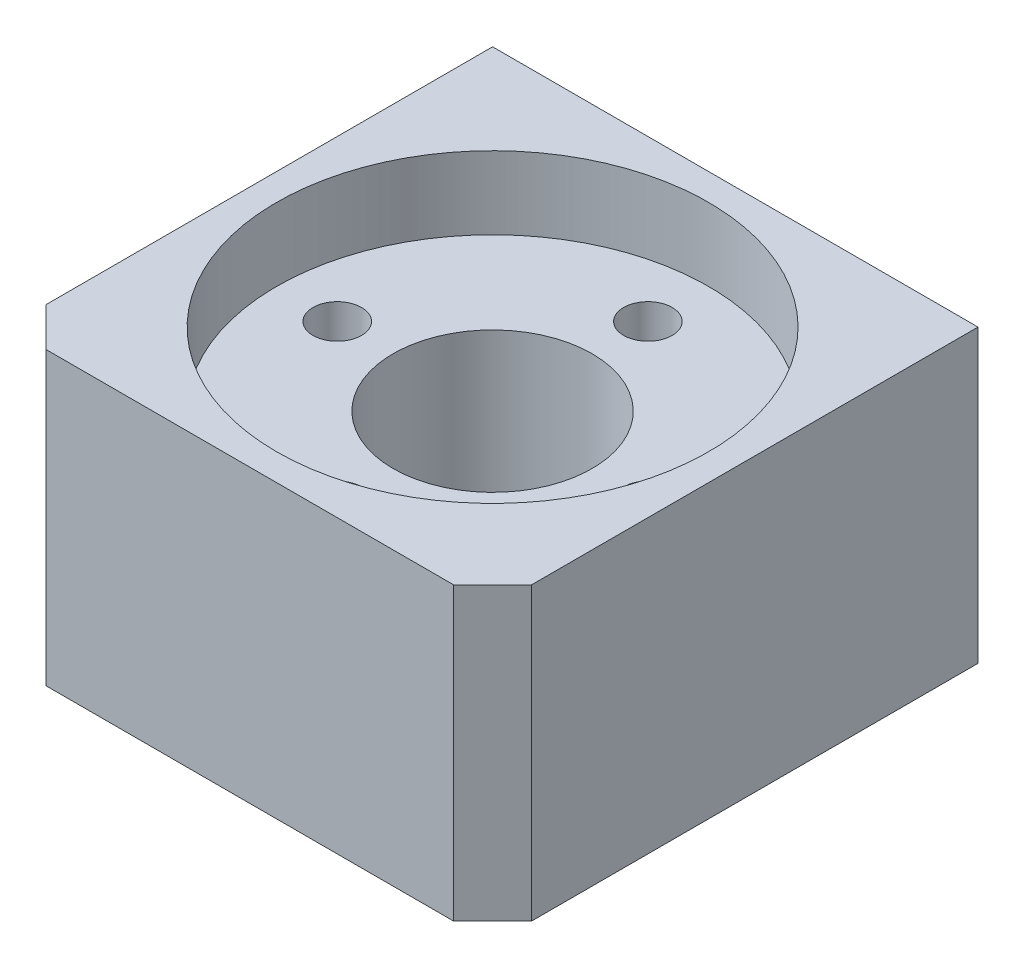
ISO-10303-21;
HEADER;
FILE_DESCRIPTION(('STEP AP214'),'2;1');
FILE_NAME('part.step','',(''),(''),'','','');
FILE_SCHEMA(('AUTOMOTIVE_DESIGN { 1 0 10303 214 1 1 1 1 }'));
ENDSEC;
DATA;
#1=APPLICATION_CONTEXT('core data for automotive mechanical design processes');
#2=APPLICATION_PROTOCOL_DEFINITION('international standard','automotive_design',2000,#1);
#3=PRODUCT_CONTEXT('',#1,'mechanical');
#4=PRODUCT('Part','Part','',(#3));
#5=PRODUCT_RELATED_PRODUCT_CATEGORY('part','',(#4));
#6=PRODUCT_DEFINITION_FORMATION('','',#4);
#7=PRODUCT_DEFINITION_CONTEXT('part definition',#1,'design');
#8=PRODUCT_DEFINITION('design','',#6,#7);
#9=PRODUCT_DEFINITION_SHAPE('','',#8);
#10=(LENGTH_UNIT() NAMED_UNIT(*) SI_UNIT(.MILLI.,.METRE.));
#11=(NAMED_UNIT(*) PLANE_ANGLE_UNIT() SI_UNIT($,.RADIAN.));
#12=(NAMED_UNIT(*) SI_UNIT($,.STERADIAN.) SOLID_ANGLE_UNIT());
#13=UNCERTAINTY_MEASURE_WITH_UNIT(LENGTH_MEASURE(1.E-05),#10,'distance_accuracy_value','');
#14=(GEOMETRIC_REPRESENTATION_CONTEXT(3) GLOBAL_UNCERTAINTY_ASSIGNED_CONTEXT((#13)) GLOBAL_UNIT_ASSIGNED_CONTEXT((#10,
#11,#12)) REPRESENTATION_CONTEXT('',''));
#15=CARTESIAN_POINT('',(0.,0.,0.));
#16=DIRECTION('',(0.,0.,1.));
#17=DIRECTION('',(1.,0.,0.));
#18=AXIS2_PLACEMENT_3D('',#15,#16,#17);
#19=CARTESIAN_POINT('',(12.5,15.,-12.5));
#20=DIRECTION('',(-1.,0.,0.));
#21=DIRECTION('',(0.,0.,1.));
#22=AXIS2_PLACEMENT_3D('',#19,#20,#21);
#23=PLANE('',#22);
#24=DIRECTION('',(0.,0.,-1.));
#25=VECTOR('',#24,1.);
#26=CARTESIAN_POINT('',(12.5,15.,-12.5));
#27=LINE('',#26,#25);
#28=CARTESIAN_POINT('',(12.5,15.,10.5));
#29=VERTEX_POINT('',#28);
#30=CARTESIAN_POINT('',(12.5,15.,-12.5));
#31=VERTEX_POINT('',#30);
#32=EDGE_CURVE('E219',#29,#31,#27,.T.);
#33=ORIENTED_EDGE('',*,*,#32,.F.);
#34=DIRECTION('',(0.,-1.,0.));
#35=VECTOR('',#34,1.);
#36=CARTESIAN_POINT('',(12.5,15.,10.5));
#37=LINE('',#36,#35);
#38=CARTESIAN_POINT('',(12.5,0.,10.5));
#39=VERTEX_POINT('',#38);
#40=EDGE_CURVE('E13',#29,#39,#37,.T.);
#41=ORIENTED_EDGE('',*,*,#40,.T.);
#42=DIRECTION('',(0.,0.,-1.));
#43=VECTOR('',#42,1.);
#44=CARTESIAN_POINT('',(12.5,0.,-12.5));
#45=LINE('',#44,#43);
#46=CARTESIAN_POINT('',(12.5,0.,-12.5));
#47=VERTEX_POINT('',#46);
#48=EDGE_CURVE('E215',#39,#47,#45,.T.);
#49=ORIENTED_EDGE('',*,*,#48,.T.);
#50=DIRECTION('',(0.,-1.,0.));
#51=VECTOR('',#50,1.);
#52=CARTESIAN_POINT('',(12.5,15.,-12.5));
#53=LINE('',#52,#51);
#54=EDGE_CURVE('E247',#31,#47,#53,.T.);
#55=ORIENTED_EDGE('',*,*,#54,.F.);
#56=EDGE_LOOP('',(#33,#41,#49,#55));
#57=FACE_BOUND('',#56,.T.);
#58=ADVANCED_FACE('F70',(#57),#23,.F.);
#59=CARTESIAN_POINT('',(-12.5,15.,-12.5));
#60=DIRECTION('',(0.,0.,1.));
#61=DIRECTION('',(1.,0.,0.));
#62=AXIS2_PLACEMENT_3D('',#59,#60,#61);
#63=PLANE('',#62);
#64=CARTESIAN_POINT('',(-7.5,7.5,-12.5));
#65=DIRECTION('',(0.,0.,-1.));
#66=DIRECTION('',(-1.,0.,0.));
#67=AXIS2_PLACEMENT_3D('',#64,#65,#66);
#68=CIRCLE('',#67,1.65);
#69=CARTESIAN_POINT('',(-9.15,7.5,-12.5));
#70=VERTEX_POINT('',#69);
#71=EDGE_CURVE('E156',#70,#70,#68,.T.);
#72=ORIENTED_EDGE('',*,*,#71,.F.);
#73=EDGE_LOOP('',(#72));
#74=FACE_BOUND('',#73,.T.);
#75=CARTESIAN_POINT('',(7.5,7.5,-12.5));
#76=DIRECTION('',(0.,0.,-1.));
#77=DIRECTION('',(-1.,0.,0.));
#78=AXIS2_PLACEMENT_3D('',#75,#76,#77);
#79=CIRCLE('',#78,1.65);
#80=CARTESIAN_POINT('',(5.85,7.5,-12.5));
#81=VERTEX_POINT('',#80);
#82=EDGE_CURVE('E155',#81,#81,#79,.T.);
#83=ORIENTED_EDGE('',*,*,#82,.F.);
#84=EDGE_LOOP('',(#83));
#85=FACE_BOUND('',#84,.T.);
#86=DIRECTION('',(-1.,0.,0.));
#87=VECTOR('',#86,1.);
#88=CARTESIAN_POINT('',(-12.5,0.,-12.5));
#89=LINE('',#88,#87);
#90=CARTESIAN_POINT('',(-12.5,0.,-12.5));
#91=VERTEX_POINT('',#90);
#92=EDGE_CURVE('E235',#47,#91,#89,.T.);
#93=ORIENTED_EDGE('',*,*,#92,.T.);
#94=DIRECTION('',(0.,-1.,0.));
#95=VECTOR('',#94,1.);
#96=CARTESIAN_POINT('',(-12.5,15.,-12.5));
#97=LINE('',#96,#95);
#98=CARTESIAN_POINT('',(-12.5,15.,-12.5));
#99=VERTEX_POINT('',#98);
#100=EDGE_CURVE('E232',#99,#91,#97,.T.);
#101=ORIENTED_EDGE('',*,*,#100,.F.);
#102=DIRECTION('',(-1.,0.,0.));
#103=VECTOR('',#102,1.);
#104=CARTESIAN_POINT('',(-12.5,15.,-12.5));
#105=LINE('',#104,#103);
#106=EDGE_CURVE('E222',#31,#99,#105,.T.);
#107=ORIENTED_EDGE('',*,*,#106,.F.);
#108=ORIENTED_EDGE('',*,*,#54,.T.);
#109=EDGE_LOOP('',(#93,#101,#107,#108));
#110=FACE_BOUND('',#109,.T.);
#111=ADVANCED_FACE('F287',(#74,#85,#110),#63,.F.);
#112=CARTESIAN_POINT('',(-12.5,15.,-12.5));
#113=DIRECTION('',(1.,0.,0.));
#114=DIRECTION('',(0.,0.,-1.));
#115=AXIS2_PLACEMENT_3D('',#112,#113,#114);
#116=PLANE('',#115);
#117=DIRECTION('',(0.,0.,1.));
#118=VECTOR('',#117,1.);
#119=CARTESIAN_POINT('',(-12.5,0.,-12.5));
#120=LINE('',#119,#118);
#121=CARTESIAN_POINT('',(-12.5,0.,10.5));
#122=VERTEX_POINT('',#121);
#123=EDGE_CURVE('E238',#91,#122,#120,.T.);
#124=ORIENTED_EDGE('',*,*,#123,.T.);
#125=DIRECTION('',(0.,1.,0.));
#126=VECTOR('',#125,1.);
#127=CARTESIAN_POINT('',(-12.5,15.,10.5));
#128=LINE('',#127,#126);
#129=CARTESIAN_POINT('',(-12.5,15.,10.5));
#130=VERTEX_POINT('',#129);
#131=EDGE_CURVE('E95',#122,#130,#128,.T.);
#132=ORIENTED_EDGE('',*,*,#131,.T.);
#133=DIRECTION('',(0.,0.,1.));
#134=VECTOR('',#133,1.);
#135=CARTESIAN_POINT('',(-12.5,15.,-12.5));
#136=LINE('',#135,#134);
#137=EDGE_CURVE('E226',#99,#130,#136,.T.);
#138=ORIENTED_EDGE('',*,*,#137,.F.);
#139=ORIENTED_EDGE('',*,*,#100,.T.);
#140=EDGE_LOOP('',(#124,#132,#138,#139));
#141=FACE_BOUND('',#140,.T.);
#142=ADVANCED_FACE('F283',(#141),#116,.F.);
#143=CARTESIAN_POINT('',(-12.5,15.,12.5));
#144=DIRECTION('',(0.,0.,-1.));
#145=DIRECTION('',(-1.,0.,0.));
#146=AXIS2_PLACEMENT_3D('',#143,#144,#145);
#147=PLANE('',#146);
#148=DIRECTION('',(1.,0.,0.));
#149=VECTOR('',#148,1.);
#150=CARTESIAN_POINT('',(-12.5,15.,12.5));
#151=LINE('',#150,#149);
#152=CARTESIAN_POINT('',(-10.5,15.,12.5));
#153=VERTEX_POINT('',#152);
#154=CARTESIAN_POINT('',(10.5,15.,12.5));
#155=VERTEX_POINT('',#154);
#156=EDGE_CURVE('E229',#153,#155,#151,.T.);
#157=ORIENTED_EDGE('',*,*,#156,.F.);
#158=DIRECTION('',(0.,-1.,0.));
#159=VECTOR('',#158,1.);
#160=CARTESIAN_POINT('',(-10.5,15.,12.5));
#161=LINE('',#160,#159);
#162=CARTESIAN_POINT('',(-10.5,0.,12.5));
#163=VERTEX_POINT('',#162);
#164=EDGE_CURVE('E254',#153,#163,#161,.T.);
#165=ORIENTED_EDGE('',*,*,#164,.T.);
#166=DIRECTION('',(1.,0.,0.));
#167=VECTOR('',#166,1.);
#168=CARTESIAN_POINT('',(-12.5,0.,12.5));
#169=LINE('',#168,#167);
#170=CARTESIAN_POINT('',(10.5,0.,12.5));
#171=VERTEX_POINT('',#170);
#172=EDGE_CURVE('E223',#163,#171,#169,.T.);
#173=ORIENTED_EDGE('',*,*,#172,.T.);
#174=DIRECTION('',(0.,1.,0.));
#175=VECTOR('',#174,1.);
#176=CARTESIAN_POINT('',(10.5,15.,12.5));
#177=LINE('',#176,#175);
#178=EDGE_CURVE('E251',#171,#155,#177,.T.);
#179=ORIENTED_EDGE('',*,*,#178,.T.);
#180=EDGE_LOOP('',(#157,#165,#173,#179));
#181=FACE_BOUND('',#180,.T.);
#182=ADVANCED_FACE('F275',(#181),#147,.F.);
#183=CARTESIAN_POINT('',(0.,15.,0.));
#184=DIRECTION('',(0.,1.,0.));
#185=DIRECTION('',(0.,0.,1.));
#186=AXIS2_PLACEMENT_3D('',#183,#184,#185);
#187=PLANE('',#186);
#188=CARTESIAN_POINT('',(0.,15.,0.));
#189=DIRECTION('',(0.,1.,0.));
#190=DIRECTION('',(0.,0.,1.));
#191=AXIS2_PLACEMENT_3D('',#188,#189,#190);
#192=CIRCLE('',#191,11.125);
#193=CARTESIAN_POINT('',(0.,15.,11.125));
#194=VERTEX_POINT('',#193);
#195=EDGE_CURVE('E207',#194,#194,#192,.T.);
#196=ORIENTED_EDGE('',*,*,#195,.F.);
#197=EDGE_LOOP('',(#196));
#198=FACE_BOUND('',#197,.T.);
#199=ORIENTED_EDGE('',*,*,#137,.T.);
#200=DIRECTION('',(-0.707106781186546,0.,-0.707106781186549));
#201=VECTOR('',#200,1.);
#202=CARTESIAN_POINT('',(-11.5,15.,11.5));
#203=LINE('',#202,#201);
#204=EDGE_CURVE('E80',#130,#153,#203,.F.);
#205=ORIENTED_EDGE('',*,*,#204,.T.);
#206=ORIENTED_EDGE('',*,*,#156,.T.);
#207=DIRECTION('',(-0.707106781186549,0.,0.707106781186546));
#208=VECTOR('',#207,1.);
#209=CARTESIAN_POINT('',(11.5,15.,11.5));
#210=LINE('',#209,#208);
#211=EDGE_CURVE('E87',#155,#29,#210,.F.);
#212=ORIENTED_EDGE('',*,*,#211,.T.);
#213=ORIENTED_EDGE('',*,*,#32,.T.);
#214=ORIENTED_EDGE('',*,*,#106,.T.);
#215=EDGE_LOOP('',(#199,#205,#206,#212,#213,#214));
#216=FACE_BOUND('',#215,.T.);
#217=ADVANCED_FACE('F271',(#198,#216),#187,.T.);
#218=CARTESIAN_POINT('',(0.,0.,0.));
#219=DIRECTION('',(0.,1.,0.));
#220=DIRECTION('',(0.,0.,1.));
#221=AXIS2_PLACEMENT_3D('',#218,#219,#220);
#222=PLANE('',#221);
#223=CARTESIAN_POINT('',(0.,0.,0.));
#224=DIRECTION('',(0.,1.,0.));
#225=DIRECTION('',(0.,0.,1.));
#226=AXIS2_PLACEMENT_3D('',#223,#224,#225);
#227=CIRCLE('',#226,5.125);
#228=CARTESIAN_POINT('',(0.,0.,5.125));
#229=VERTEX_POINT('',#228);
#230=EDGE_CURVE('E203',#229,#229,#227,.T.);
#231=ORIENTED_EDGE('',*,*,#230,.T.);
#232=EDGE_LOOP('',(#231));
#233=FACE_BOUND('',#232,.T.);
#234=ORIENTED_EDGE('',*,*,#172,.F.);
#235=DIRECTION('',(0.707106781186546,0.,0.707106781186549));
#236=VECTOR('',#235,1.);
#237=CARTESIAN_POINT('',(-10.5,0.,12.5));
#238=LINE('',#237,#236);
#239=EDGE_CURVE('E261',#163,#122,#238,.F.);
#240=ORIENTED_EDGE('',*,*,#239,.T.);
#241=ORIENTED_EDGE('',*,*,#123,.F.);
#242=ORIENTED_EDGE('',*,*,#92,.F.);
#243=ORIENTED_EDGE('',*,*,#48,.F.);
#244=DIRECTION('',(0.707106781186549,0.,-0.707106781186546));
#245=VECTOR('',#244,1.);
#246=CARTESIAN_POINT('',(12.5,0.,10.5));
#247=LINE('',#246,#245);
#248=EDGE_CURVE('E258',#39,#171,#247,.F.);
#249=ORIENTED_EDGE('',*,*,#248,.T.);
#250=EDGE_LOOP('',(#234,#240,#241,#242,#243,#249));
#251=FACE_BOUND('',#250,.T.);
#252=ADVANCED_FACE('F281',(#233,#251),#222,.F.);
#253=CARTESIAN_POINT('',(0.,11.25,0.));
#254=DIRECTION('',(0.,1.,0.));
#255=DIRECTION('',(0.,0.,1.));
#256=AXIS2_PLACEMENT_3D('',#253,#254,#255);
#257=CYLINDRICAL_SURFACE('',#256,11.125);
#258=CARTESIAN_POINT('',(0.,11.25,0.));
#259=DIRECTION('',(0.,1.,0.));
#260=DIRECTION('',(0.,0.,1.));
#261=AXIS2_PLACEMENT_3D('',#258,#259,#260);
#262=CIRCLE('',#261,11.125);
#263=CARTESIAN_POINT('',(0.,11.25,11.125));
#264=VERTEX_POINT('',#263);
#265=EDGE_CURVE('E211',#264,#264,#262,.T.);
#266=ORIENTED_EDGE('',*,*,#265,.F.);
#267=EDGE_LOOP('',(#266));
#268=FACE_BOUND('',#267,.T.);
#269=ORIENTED_EDGE('',*,*,#195,.T.);
#270=EDGE_LOOP('',(#269));
#271=FACE_BOUND('',#270,.T.);
#272=ADVANCED_FACE('F317',(#268,#271),#257,.F.);
#273=CARTESIAN_POINT('',(0.,11.25,0.));
#274=DIRECTION('',(0.,1.,0.));
#275=DIRECTION('',(0.,0.,1.));
#276=AXIS2_PLACEMENT_3D('',#273,#274,#275);
#277=PLANE('',#276);
#278=CARTESIAN_POINT('',(8.,11.25,0.));
#279=DIRECTION('',(0.,1.,0.));
#280=DIRECTION('',(0.,0.,1.));
#281=AXIS2_PLACEMENT_3D('',#278,#279,#280);
#282=CIRCLE('',#281,1.24999999999999);
#283=CARTESIAN_POINT('',(8.,11.25,1.24999999999999));
#284=VERTEX_POINT('',#283);
#285=EDGE_CURVE('E170',#284,#284,#282,.T.);
#286=ORIENTED_EDGE('',*,*,#285,.F.);
#287=EDGE_LOOP('',(#286));
#288=FACE_BOUND('',#287,.T.);
#289=CARTESIAN_POINT('',(0.,11.25,-8.));
#290=DIRECTION('',(0.,1.,0.));
#291=DIRECTION('',(0.,0.,1.));
#292=AXIS2_PLACEMENT_3D('',#289,#290,#291);
#293=CIRCLE('',#292,1.24999999999999);
#294=CARTESIAN_POINT('',(0.,11.25,-6.75000000000001));
#295=VERTEX_POINT('',#294);
#296=EDGE_CURVE('E178',#295,#295,#293,.T.);
#297=ORIENTED_EDGE('',*,*,#296,.F.);
#298=EDGE_LOOP('',(#297));
#299=FACE_BOUND('',#298,.T.);
#300=CARTESIAN_POINT('',(0.,11.25,8.));
#301=DIRECTION('',(0.,1.,0.));
#302=DIRECTION('',(0.,0.,1.));
#303=AXIS2_PLACEMENT_3D('',#300,#301,#302);
#304=CIRCLE('',#303,1.24999999999999);
#305=CARTESIAN_POINT('',(0.,11.25,9.24999999999999));
#306=VERTEX_POINT('',#305);
#307=EDGE_CURVE('E186',#306,#306,#304,.T.);
#308=ORIENTED_EDGE('',*,*,#307,.F.);
#309=EDGE_LOOP('',(#308));
#310=FACE_BOUND('',#309,.T.);
#311=CARTESIAN_POINT('',(-8.,11.25,0.));
#312=DIRECTION('',(0.,1.,0.));
#313=DIRECTION('',(0.,0.,1.));
#314=AXIS2_PLACEMENT_3D('',#311,#312,#313);
#315=CIRCLE('',#314,1.24999999999999);
#316=CARTESIAN_POINT('',(-8.,11.25,1.24999999999999));
#317=VERTEX_POINT('',#316);
#318=EDGE_CURVE('E194',#317,#317,#315,.T.);
#319=ORIENTED_EDGE('',*,*,#318,.F.);
#320=EDGE_LOOP('',(#319));
#321=FACE_BOUND('',#320,.T.);
#322=CARTESIAN_POINT('',(0.,11.25,0.));
#323=DIRECTION('',(0.,1.,0.));
#324=DIRECTION('',(0.,0.,1.));
#325=AXIS2_PLACEMENT_3D('',#322,#323,#324);
#326=CIRCLE('',#325,5.125);
#327=CARTESIAN_POINT('',(0.,11.25,5.125));
#328=VERTEX_POINT('',#327);
#329=EDGE_CURVE('E202',#328,#328,#326,.T.);
#330=ORIENTED_EDGE('',*,*,#329,.F.);
#331=EDGE_LOOP('',(#330));
#332=FACE_BOUND('',#331,.T.);
#333=ORIENTED_EDGE('',*,*,#265,.T.);
#334=EDGE_LOOP('',(#333));
#335=FACE_BOUND('',#334,.T.);
#336=ADVANCED_FACE('F324',(#288,#299,#310,#321,#332,#335),#277,.T.);
#337=CARTESIAN_POINT('',(0.,0.,0.));
#338=DIRECTION('',(0.,1.,0.));
#339=DIRECTION('',(0.,0.,1.));
#340=AXIS2_PLACEMENT_3D('',#337,#338,#339);
#341=CYLINDRICAL_SURFACE('',#340,5.125);
#342=ORIENTED_EDGE('',*,*,#230,.F.);
#343=EDGE_LOOP('',(#342));
#344=FACE_BOUND('',#343,.T.);
#345=ORIENTED_EDGE('',*,*,#329,.T.);
#346=EDGE_LOOP('',(#345));
#347=FACE_BOUND('',#346,.T.);
#348=ADVANCED_FACE('F328',(#344,#347),#341,.F.);
#349=CARTESIAN_POINT('',(-8.,5.25,0.));
#350=DIRECTION('',(0.,1.,0.));
#351=DIRECTION('',(0.,0.,1.));
#352=AXIS2_PLACEMENT_3D('',#349,#350,#351);
#353=CONICAL_SURFACE('',#352,1.25,1.02974425867665);
#354=CARTESIAN_POINT('',(-8.,4.49892422621555,0.));
#355=VERTEX_POINT('',#354);
#356=VERTEX_LOOP('',#355);
#357=FACE_BOUND('',#356,.T.);
#358=CARTESIAN_POINT('',(-8.,5.25,0.));
#359=DIRECTION('',(0.,1.,0.));
#360=DIRECTION('',(0.,0.,1.));
#361=AXIS2_PLACEMENT_3D('',#358,#359,#360);
#362=CIRCLE('',#361,1.25);
#363=CARTESIAN_POINT('',(-8.,5.25,1.25));
#364=VERTEX_POINT('',#363);
#365=EDGE_CURVE('E198',#364,#364,#362,.T.);
#366=ORIENTED_EDGE('',*,*,#365,.T.);
#367=EDGE_LOOP('',(#366));
#368=FACE_BOUND('',#367,.T.);
#369=ADVANCED_FACE('F332',(#357,#368),#353,.F.);
#370=CARTESIAN_POINT('',(-8.,11.25,0.));
#371=DIRECTION('',(0.,1.,0.));
#372=DIRECTION('',(0.,0.,1.));
#373=AXIS2_PLACEMENT_3D('',#370,#371,#372);
#374=CYLINDRICAL_SURFACE('',#373,1.24999999999999);
#375=ORIENTED_EDGE('',*,*,#365,.F.);
#376=EDGE_LOOP('',(#375));
#377=FACE_BOUND('',#376,.T.);
#378=ORIENTED_EDGE('',*,*,#318,.T.);
#379=EDGE_LOOP('',(#378));
#380=FACE_BOUND('',#379,.T.);
#381=ADVANCED_FACE('F336',(#377,#380),#374,.F.);
#382=CARTESIAN_POINT('',(0.,5.25,8.));
#383=DIRECTION('',(0.,1.,0.));
#384=DIRECTION('',(0.,0.,1.));
#385=AXIS2_PLACEMENT_3D('',#382,#383,#384);
#386=CONICAL_SURFACE('',#385,1.25,1.02974425867665);
#387=CARTESIAN_POINT('',(0.,4.49892422621555,8.));
#388=VERTEX_POINT('',#387);
#389=VERTEX_LOOP('',#388);
#390=FACE_BOUND('',#389,.T.);
#391=CARTESIAN_POINT('',(0.,5.25,8.));
#392=DIRECTION('',(0.,1.,0.));
#393=DIRECTION('',(0.,0.,1.));
#394=AXIS2_PLACEMENT_3D('',#391,#392,#393);
#395=CIRCLE('',#394,1.25);
#396=CARTESIAN_POINT('',(0.,5.25,9.25));
#397=VERTEX_POINT('',#396);
#398=EDGE_CURVE('E190',#397,#397,#395,.T.);
#399=ORIENTED_EDGE('',*,*,#398,.T.);
#400=EDGE_LOOP('',(#399));
#401=FACE_BOUND('',#400,.T.);
#402=ADVANCED_FACE('F340',(#390,#401),#386,.F.);
#403=CARTESIAN_POINT('',(0.,11.25,8.));
#404=DIRECTION('',(0.,1.,0.));
#405=DIRECTION('',(0.,0.,1.));
#406=AXIS2_PLACEMENT_3D('',#403,#404,#405);
#407=CYLINDRICAL_SURFACE('',#406,1.24999999999999);
#408=ORIENTED_EDGE('',*,*,#398,.F.);
#409=EDGE_LOOP('',(#408));
#410=FACE_BOUND('',#409,.T.);
#411=ORIENTED_EDGE('',*,*,#307,.T.);
#412=EDGE_LOOP('',(#411));
#413=FACE_BOUND('',#412,.T.);
#414=ADVANCED_FACE('F344',(#410,#413),#407,.F.);
#415=CARTESIAN_POINT('',(0.,5.25,-8.));
#416=DIRECTION('',(0.,1.,0.));
#417=DIRECTION('',(0.,0.,1.));
#418=AXIS2_PLACEMENT_3D('',#415,#416,#417);
#419=CONICAL_SURFACE('',#418,1.25,1.02974425867665);
#420=CARTESIAN_POINT('',(0.,4.49892422621555,-8.));
#421=VERTEX_POINT('',#420);
#422=VERTEX_LOOP('',#421);
#423=FACE_BOUND('',#422,.T.);
#424=CARTESIAN_POINT('',(0.,5.25,-8.));
#425=DIRECTION('',(0.,1.,0.));
#426=DIRECTION('',(0.,0.,1.));
#427=AXIS2_PLACEMENT_3D('',#424,#425,#426);
#428=CIRCLE('',#427,1.25);
#429=CARTESIAN_POINT('',(0.,5.25,-6.75));
#430=VERTEX_POINT('',#429);
#431=EDGE_CURVE('E182',#430,#430,#428,.T.);
#432=ORIENTED_EDGE('',*,*,#431,.T.);
#433=EDGE_LOOP('',(#432));
#434=FACE_BOUND('',#433,.T.);
#435=ADVANCED_FACE('F348',(#423,#434),#419,.F.);
#436=CARTESIAN_POINT('',(0.,11.25,-8.));
#437=DIRECTION('',(0.,1.,0.));
#438=DIRECTION('',(0.,0.,1.));
#439=AXIS2_PLACEMENT_3D('',#436,#437,#438);
#440=CYLINDRICAL_SURFACE('',#439,1.24999999999999);
#441=ORIENTED_EDGE('',*,*,#431,.F.);
#442=EDGE_LOOP('',(#441));
#443=FACE_BOUND('',#442,.T.);
#444=ORIENTED_EDGE('',*,*,#296,.T.);
#445=EDGE_LOOP('',(#444));
#446=FACE_BOUND('',#445,.T.);
#447=ADVANCED_FACE('F352',(#443,#446),#440,.F.);
#448=CARTESIAN_POINT('',(8.,5.25,0.));
#449=DIRECTION('',(0.,1.,0.));
#450=DIRECTION('',(0.,0.,1.));
#451=AXIS2_PLACEMENT_3D('',#448,#449,#450);
#452=CONICAL_SURFACE('',#451,1.25,1.02974425867665);
#453=CARTESIAN_POINT('',(8.,4.49892422621555,0.));
#454=VERTEX_POINT('',#453);
#455=VERTEX_LOOP('',#454);
#456=FACE_BOUND('',#455,.T.);
#457=CARTESIAN_POINT('',(8.,5.25,0.));
#458=DIRECTION('',(0.,1.,0.));
#459=DIRECTION('',(0.,0.,1.));
#460=AXIS2_PLACEMENT_3D('',#457,#458,#459);
#461=CIRCLE('',#460,1.25);
#462=CARTESIAN_POINT('',(8.,5.25,1.25));
#463=VERTEX_POINT('',#462);
#464=EDGE_CURVE('E174',#463,#463,#461,.T.);
#465=ORIENTED_EDGE('',*,*,#464,.T.);
#466=EDGE_LOOP('',(#465));
#467=FACE_BOUND('',#466,.T.);
#468=ADVANCED_FACE('F356',(#456,#467),#452,.F.);
#469=CARTESIAN_POINT('',(8.,11.25,0.));
#470=DIRECTION('',(0.,1.,0.));
#471=DIRECTION('',(0.,0.,1.));
#472=AXIS2_PLACEMENT_3D('',#469,#470,#471);
#473=CYLINDRICAL_SURFACE('',#472,1.24999999999999);
#474=ORIENTED_EDGE('',*,*,#464,.F.);
#475=EDGE_LOOP('',(#474));
#476=FACE_BOUND('',#475,.T.);
#477=ORIENTED_EDGE('',*,*,#285,.T.);
#478=EDGE_LOOP('',(#477));
#479=FACE_BOUND('',#478,.T.);
#480=ADVANCED_FACE('F360',(#476,#479),#473,.F.);
#481=CARTESIAN_POINT('',(7.5,7.5,-4.5));
#482=DIRECTION('',(0.,0.,-1.));
#483=DIRECTION('',(-1.,0.,0.));
#484=AXIS2_PLACEMENT_3D('',#481,#482,#483);
#485=CONICAL_SURFACE('',#484,1.65,1.02974425867665);
#486=CARTESIAN_POINT('',(7.5,7.5,-3.50857997860453));
#487=VERTEX_POINT('',#486);
#488=VERTEX_LOOP('',#487);
#489=FACE_BOUND('',#488,.T.);
#490=CARTESIAN_POINT('',(7.5,7.5,-4.5));
#491=DIRECTION('',(0.,0.,-1.));
#492=DIRECTION('',(-1.,0.,0.));
#493=AXIS2_PLACEMENT_3D('',#490,#491,#492);
#494=CIRCLE('',#493,1.65);
#495=CARTESIAN_POINT('',(5.85,7.5,-4.5));
#496=VERTEX_POINT('',#495);
#497=EDGE_CURVE('E162',#496,#496,#494,.T.);
#498=ORIENTED_EDGE('',*,*,#497,.T.);
#499=EDGE_LOOP('',(#498));
#500=FACE_BOUND('',#499,.T.);
#501=ADVANCED_FACE('F364',(#489,#500),#485,.F.);
#502=CARTESIAN_POINT('',(7.5,7.5,-12.5));
#503=DIRECTION('',(0.,0.,-1.));
#504=DIRECTION('',(-1.,0.,0.));
#505=AXIS2_PLACEMENT_3D('',#502,#503,#504);
#506=CYLINDRICAL_SURFACE('',#505,1.65);
#507=ORIENTED_EDGE('',*,*,#497,.F.);
#508=EDGE_LOOP('',(#507));
#509=FACE_BOUND('',#508,.T.);
#510=ORIENTED_EDGE('',*,*,#82,.T.);
#511=EDGE_LOOP('',(#510));
#512=FACE_BOUND('',#511,.T.);
#513=ADVANCED_FACE('F148',(#509,#512),#506,.F.);
#514=CARTESIAN_POINT('',(-7.5,7.5,-4.5));
#515=DIRECTION('',(0.,0.,-1.));
#516=DIRECTION('',(-1.,0.,0.));
#517=AXIS2_PLACEMENT_3D('',#514,#515,#516);
#518=CONICAL_SURFACE('',#517,1.65,1.02974425867665);
#519=CARTESIAN_POINT('',(-7.5,7.5,-3.50857997860453));
#520=VERTEX_POINT('',#519);
#521=VERTEX_LOOP('',#520);
#522=FACE_BOUND('',#521,.T.);
#523=CARTESIAN_POINT('',(-7.5,7.5,-4.5));
#524=DIRECTION('',(0.,0.,-1.));
#525=DIRECTION('',(-1.,0.,0.));
#526=AXIS2_PLACEMENT_3D('',#523,#524,#525);
#527=CIRCLE('',#526,1.65);
#528=CARTESIAN_POINT('',(-9.15,7.5,-4.5));
#529=VERTEX_POINT('',#528);
#530=EDGE_CURVE('E152',#529,#529,#527,.T.);
#531=ORIENTED_EDGE('',*,*,#530,.T.);
#532=EDGE_LOOP('',(#531));
#533=FACE_BOUND('',#532,.T.);
#534=ADVANCED_FACE('F144',(#522,#533),#518,.F.);
#535=CARTESIAN_POINT('',(-7.5,7.5,-12.5));
#536=DIRECTION('',(0.,0.,-1.));
#537=DIRECTION('',(-1.,0.,0.));
#538=AXIS2_PLACEMENT_3D('',#535,#536,#537);
#539=CYLINDRICAL_SURFACE('',#538,1.65);
#540=ORIENTED_EDGE('',*,*,#530,.F.);
#541=EDGE_LOOP('',(#540));
#542=FACE_BOUND('',#541,.T.);
#543=ORIENTED_EDGE('',*,*,#71,.T.);
#544=EDGE_LOOP('',(#543));
#545=FACE_BOUND('',#544,.T.);
#546=ADVANCED_FACE('F147',(#542,#545),#539,.F.);
#547=CARTESIAN_POINT('',(-10.5,15.,12.5));
#548=DIRECTION('',(0.707106781186549,0.,-0.707106781186546));
#549=DIRECTION('',(0.,-1.,0.));
#550=AXIS2_PLACEMENT_3D('',#547,#548,#549);
#551=PLANE('',#550);
#552=ORIENTED_EDGE('',*,*,#204,.F.);
#553=ORIENTED_EDGE('',*,*,#131,.F.);
#554=ORIENTED_EDGE('',*,*,#239,.F.);
#555=ORIENTED_EDGE('',*,*,#164,.F.);
#556=EDGE_LOOP('',(#552,#553,#554,#555));
#557=FACE_BOUND('',#556,.T.);
#558=ADVANCED_FACE('F278',(#557),#551,.F.);
#559=CARTESIAN_POINT('',(12.5,15.,10.5));
#560=DIRECTION('',(-0.707106781186546,0.,-0.707106781186549));
#561=DIRECTION('',(0.,-1.,0.));
#562=AXIS2_PLACEMENT_3D('',#559,#560,#561);
#563=PLANE('',#562);
#564=ORIENTED_EDGE('',*,*,#211,.F.);
#565=ORIENTED_EDGE('',*,*,#178,.F.);
#566=ORIENTED_EDGE('',*,*,#248,.F.);
#567=ORIENTED_EDGE('',*,*,#40,.F.);
#568=EDGE_LOOP('',(#564,#565,#566,#567));
#569=FACE_BOUND('',#568,.T.);
#570=ADVANCED_FACE('F73',(#569),#563,.F.);
#571=CLOSED_SHELL('',(#58,#111,#142,#182,#217,#252,#272,#336,#348,#369,#381,#402,#414,#435,#447,
#468,#480,#501,#513,#534,#546,#558,#570));
#572=MANIFOLD_SOLID_BREP('B2',#571);
#573=ADVANCED_BREP_SHAPE_REPRESENTATION('',(#18,#572),#14);
#574=SHAPE_DEFINITION_REPRESENTATION(#9,#573);
ENDSEC;
END-ISO-10303-21;
